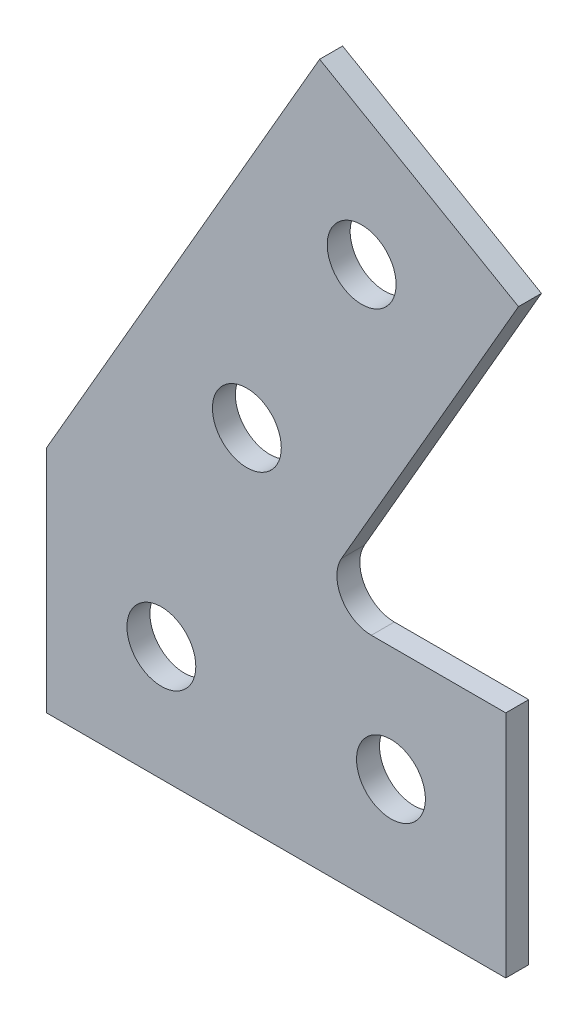
ISO-10303-21;
HEADER;
FILE_DESCRIPTION(('STEP AP214'),'2;1');
FILE_NAME('part.step','',(''),(''),'','','');
FILE_SCHEMA(('AUTOMOTIVE_DESIGN { 1 0 10303 214 1 1 1 1 }'));
ENDSEC;
DATA;
#1=APPLICATION_CONTEXT('core data for automotive mechanical design processes');
#2=APPLICATION_PROTOCOL_DEFINITION('international standard','automotive_design',2000,#1);
#3=PRODUCT_CONTEXT('',#1,'mechanical');
#4=PRODUCT('Part','Part','',(#3));
#5=PRODUCT_RELATED_PRODUCT_CATEGORY('part','',(#4));
#6=PRODUCT_DEFINITION_FORMATION('','',#4);
#7=PRODUCT_DEFINITION_CONTEXT('part definition',#1,'design');
#8=PRODUCT_DEFINITION('design','',#6,#7);
#9=PRODUCT_DEFINITION_SHAPE('','',#8);
#10=(LENGTH_UNIT() NAMED_UNIT(*) SI_UNIT(.MILLI.,.METRE.));
#11=(NAMED_UNIT(*) PLANE_ANGLE_UNIT() SI_UNIT($,.RADIAN.));
#12=(NAMED_UNIT(*) SI_UNIT($,.STERADIAN.) SOLID_ANGLE_UNIT());
#13=UNCERTAINTY_MEASURE_WITH_UNIT(LENGTH_MEASURE(1.E-05),#10,'distance_accuracy_value','');
#14=(GEOMETRIC_REPRESENTATION_CONTEXT(3) GLOBAL_UNCERTAINTY_ASSIGNED_CONTEXT((#13)) GLOBAL_UNIT_ASSIGNED_CONTEXT((#10,
#11,#12)) REPRESENTATION_CONTEXT('',''));
#15=CARTESIAN_POINT('',(0.,0.,0.));
#16=DIRECTION('',(0.,0.,1.));
#17=DIRECTION('',(1.,0.,0.));
#18=AXIS2_PLACEMENT_3D('',#15,#16,#17);
#19=CARTESIAN_POINT('',(14.1450815951458,11.5,1.));
#20=DIRECTION('',(0.,0.,-1.));
#21=DIRECTION('',(-1.,0.,0.));
#22=AXIS2_PLACEMENT_3D('',#19,#20,#21);
#23=PLANE('',#22);
#24=DIRECTION('',(0.,-1.,0.));
#25=VECTOR('',#24,1.);
#26=CARTESIAN_POINT('',(0.,0.,1.));
#27=LINE('',#26,#25);
#28=CARTESIAN_POINT('',(0.,10.,1.));
#29=VERTEX_POINT('',#28);
#30=CARTESIAN_POINT('',(0.,0.,1.));
#31=VERTEX_POINT('',#30);
#32=EDGE_CURVE('E145',#29,#31,#27,.T.);
#33=ORIENTED_EDGE('',*,*,#32,.T.);
#34=DIRECTION('',(1.,0.,0.));
#35=VECTOR('',#34,1.);
#36=CARTESIAN_POINT('',(0.,0.,1.));
#37=LINE('',#36,#35);
#38=CARTESIAN_POINT('',(20.,0.,1.));
#39=VERTEX_POINT('',#38);
#40=EDGE_CURVE('E93',#31,#39,#37,.T.);
#41=ORIENTED_EDGE('',*,*,#40,.T.);
#42=DIRECTION('',(0.,1.,0.));
#43=VECTOR('',#42,1.);
#44=CARTESIAN_POINT('',(20.,0.,1.));
#45=LINE('',#44,#43);
#46=CARTESIAN_POINT('',(20.,10.,1.));
#47=VERTEX_POINT('',#46);
#48=EDGE_CURVE('E160',#39,#47,#45,.T.);
#49=ORIENTED_EDGE('',*,*,#48,.T.);
#50=DIRECTION('',(-1.,0.,0.));
#51=VECTOR('',#50,1.);
#52=CARTESIAN_POINT('',(20.,10.,1.));
#53=LINE('',#52,#51);
#54=CARTESIAN_POINT('',(14.1450815951458,10.,1.));
#55=VERTEX_POINT('',#54);
#56=EDGE_CURVE('E173',#47,#55,#53,.T.);
#57=ORIENTED_EDGE('',*,*,#56,.T.);
#58=CARTESIAN_POINT('',(14.1450815951458,11.5,1.));
#59=DIRECTION('',(0.,0.,-1.));
#60=DIRECTION('',(-1.,0.,0.));
#61=AXIS2_PLACEMENT_3D('',#58,#59,#60);
#62=CIRCLE('',#61,1.5);
#63=CARTESIAN_POINT('',(12.8460434894692,12.25,1.));
#64=VERTEX_POINT('',#63);
#65=EDGE_CURVE('E112',#55,#64,#62,.T.);
#66=ORIENTED_EDGE('',*,*,#65,.T.);
#67=DIRECTION('',(0.500000000000001,0.866025403784438,0.));
#68=VECTOR('',#67,1.);
#69=CARTESIAN_POINT('',(12.8460434894692,12.25,1.));
#70=LINE('',#69,#68);
#71=CARTESIAN_POINT('',(20.5536695831507,25.6,1.));
#72=VERTEX_POINT('',#71);
#73=EDGE_CURVE('E106',#64,#72,#70,.T.);
#74=ORIENTED_EDGE('',*,*,#73,.T.);
#75=DIRECTION('',(-0.866025403784438,0.500000000000001,0.));
#76=VECTOR('',#75,1.);
#77=CARTESIAN_POINT('',(11.8934155453063,30.6,1.));
#78=LINE('',#77,#76);
#79=CARTESIAN_POINT('',(11.8934155453063,30.6,1.));
#80=VERTEX_POINT('',#79);
#81=EDGE_CURVE('E110',#72,#80,#78,.T.);
#82=ORIENTED_EDGE('',*,*,#81,.T.);
#83=DIRECTION('',(-0.500000000000001,-0.866025403784438,0.));
#84=VECTOR('',#83,1.);
#85=CARTESIAN_POINT('',(0.,10.,1.));
#86=LINE('',#85,#84);
#87=EDGE_CURVE('E50',#80,#29,#86,.T.);
#88=ORIENTED_EDGE('',*,*,#87,.T.);
#89=EDGE_LOOP('',(#33,#41,#49,#57,#66,#74,#82,#88));
#90=FACE_BOUND('',#89,.T.);
#91=CARTESIAN_POINT('',(5.,5.,1.));
#92=DIRECTION('',(0.,0.,1.));
#93=DIRECTION('',(1.,0.,0.));
#94=AXIS2_PLACEMENT_3D('',#91,#92,#93);
#95=CIRCLE('',#94,1.5);
#96=CARTESIAN_POINT('',(6.5,5.,1.));
#97=VERTEX_POINT('',#96);
#98=EDGE_CURVE('E134',#97,#97,#95,.T.);
#99=ORIENTED_EDGE('',*,*,#98,.F.);
#100=EDGE_LOOP('',(#99));
#101=FACE_BOUND('',#100,.T.);
#102=CARTESIAN_POINT('',(15.,5.,1.));
#103=DIRECTION('',(0.,0.,1.));
#104=DIRECTION('',(1.,0.,0.));
#105=AXIS2_PLACEMENT_3D('',#102,#103,#104);
#106=CIRCLE('',#105,1.5);
#107=CARTESIAN_POINT('',(16.5,5.,1.));
#108=VERTEX_POINT('',#107);
#109=EDGE_CURVE('E182',#108,#108,#106,.T.);
#110=ORIENTED_EDGE('',*,*,#109,.F.);
#111=EDGE_LOOP('',(#110));
#112=FACE_BOUND('',#111,.T.);
#113=CARTESIAN_POINT('',(8.7235425642285,15.1096189432334,1.));
#114=DIRECTION('',(0.,0.,1.));
#115=DIRECTION('',(1.,0.,0.));
#116=AXIS2_PLACEMENT_3D('',#113,#114,#115);
#117=CIRCLE('',#116,1.5);
#118=CARTESIAN_POINT('',(10.2235425642285,15.1096189432334,1.));
#119=VERTEX_POINT('',#118);
#120=EDGE_CURVE('E188',#119,#119,#117,.T.);
#121=ORIENTED_EDGE('',*,*,#120,.F.);
#122=EDGE_LOOP('',(#121));
#123=FACE_BOUND('',#122,.T.);
#124=CARTESIAN_POINT('',(13.7235425642285,23.7698729810778,1.));
#125=DIRECTION('',(0.,0.,1.));
#126=DIRECTION('',(1.,0.,0.));
#127=AXIS2_PLACEMENT_3D('',#124,#125,#126);
#128=CIRCLE('',#127,1.5);
#129=CARTESIAN_POINT('',(15.2235425642285,23.7698729810778,1.));
#130=VERTEX_POINT('',#129);
#131=EDGE_CURVE('E194',#130,#130,#128,.T.);
#132=ORIENTED_EDGE('',*,*,#131,.F.);
#133=EDGE_LOOP('',(#132));
#134=FACE_BOUND('',#133,.T.);
#135=ADVANCED_FACE('F33',(#90,#101,#112,#123,#134),#23,.F.);
#136=CARTESIAN_POINT('',(14.1450815951458,11.5,0.));
#137=DIRECTION('',(0.,0.,-1.));
#138=DIRECTION('',(-1.,0.,0.));
#139=AXIS2_PLACEMENT_3D('',#136,#137,#138);
#140=PLANE('',#139);
#141=CARTESIAN_POINT('',(8.7235425642285,15.1096189432334,0.));
#142=DIRECTION('',(0.,0.,1.));
#143=DIRECTION('',(1.,0.,0.));
#144=AXIS2_PLACEMENT_3D('',#141,#142,#143);
#145=CIRCLE('',#144,1.5);
#146=CARTESIAN_POINT('',(10.2235425642285,15.1096189432334,0.));
#147=VERTEX_POINT('',#146);
#148=EDGE_CURVE('E191',#147,#147,#145,.T.);
#149=ORIENTED_EDGE('',*,*,#148,.T.);
#150=EDGE_LOOP('',(#149));
#151=FACE_BOUND('',#150,.T.);
#152=CARTESIAN_POINT('',(5.,5.,0.));
#153=DIRECTION('',(0.,0.,1.));
#154=DIRECTION('',(1.,0.,0.));
#155=AXIS2_PLACEMENT_3D('',#152,#153,#154);
#156=CIRCLE('',#155,1.5);
#157=CARTESIAN_POINT('',(6.5,5.,0.));
#158=VERTEX_POINT('',#157);
#159=EDGE_CURVE('E179',#158,#158,#156,.T.);
#160=ORIENTED_EDGE('',*,*,#159,.T.);
#161=EDGE_LOOP('',(#160));
#162=FACE_BOUND('',#161,.T.);
#163=DIRECTION('',(0.,-1.,0.));
#164=VECTOR('',#163,1.);
#165=CARTESIAN_POINT('',(0.,0.,0.));
#166=LINE('',#165,#164);
#167=CARTESIAN_POINT('',(0.,10.,0.));
#168=VERTEX_POINT('',#167);
#169=CARTESIAN_POINT('',(0.,0.,0.));
#170=VERTEX_POINT('',#169);
#171=EDGE_CURVE('E130',#168,#170,#166,.T.);
#172=ORIENTED_EDGE('',*,*,#171,.F.);
#173=DIRECTION('',(-0.500000000000001,-0.866025403784438,0.));
#174=VECTOR('',#173,1.);
#175=CARTESIAN_POINT('',(0.,10.,0.));
#176=LINE('',#175,#174);
#177=CARTESIAN_POINT('',(11.8934155453063,30.6,0.));
#178=VERTEX_POINT('',#177);
#179=EDGE_CURVE('E85',#178,#168,#176,.T.);
#180=ORIENTED_EDGE('',*,*,#179,.F.);
#181=DIRECTION('',(-0.866025403784438,0.500000000000001,0.));
#182=VECTOR('',#181,1.);
#183=CARTESIAN_POINT('',(11.8934155453063,30.6,0.));
#184=LINE('',#183,#182);
#185=CARTESIAN_POINT('',(20.5536695831507,25.6,0.));
#186=VERTEX_POINT('',#185);
#187=EDGE_CURVE('E79',#186,#178,#184,.T.);
#188=ORIENTED_EDGE('',*,*,#187,.F.);
#189=DIRECTION('',(0.500000000000001,0.866025403784438,0.));
#190=VECTOR('',#189,1.);
#191=CARTESIAN_POINT('',(12.8460434894692,12.25,0.));
#192=LINE('',#191,#190);
#193=CARTESIAN_POINT('',(12.8460434894692,12.25,0.));
#194=VERTEX_POINT('',#193);
#195=EDGE_CURVE('E120',#194,#186,#192,.T.);
#196=ORIENTED_EDGE('',*,*,#195,.F.);
#197=CARTESIAN_POINT('',(14.1450815951458,11.5,0.));
#198=DIRECTION('',(0.,0.,-1.));
#199=DIRECTION('',(-1.,0.,0.));
#200=AXIS2_PLACEMENT_3D('',#197,#198,#199);
#201=CIRCLE('',#200,1.5);
#202=CARTESIAN_POINT('',(14.1450815951458,10.,0.));
#203=VERTEX_POINT('',#202);
#204=EDGE_CURVE('E140',#203,#194,#201,.T.);
#205=ORIENTED_EDGE('',*,*,#204,.F.);
#206=DIRECTION('',(-1.,0.,0.));
#207=VECTOR('',#206,1.);
#208=CARTESIAN_POINT('',(20.,10.,0.));
#209=LINE('',#208,#207);
#210=CARTESIAN_POINT('',(20.,10.,0.));
#211=VERTEX_POINT('',#210);
#212=EDGE_CURVE('E138',#211,#203,#209,.T.);
#213=ORIENTED_EDGE('',*,*,#212,.F.);
#214=DIRECTION('',(0.,1.,0.));
#215=VECTOR('',#214,1.);
#216=CARTESIAN_POINT('',(20.,0.,0.));
#217=LINE('',#216,#215);
#218=CARTESIAN_POINT('',(20.,0.,0.));
#219=VERTEX_POINT('',#218);
#220=EDGE_CURVE('E136',#219,#211,#217,.T.);
#221=ORIENTED_EDGE('',*,*,#220,.F.);
#222=DIRECTION('',(1.,0.,0.));
#223=VECTOR('',#222,1.);
#224=CARTESIAN_POINT('',(0.,0.,0.));
#225=LINE('',#224,#223);
#226=EDGE_CURVE('E133',#170,#219,#225,.T.);
#227=ORIENTED_EDGE('',*,*,#226,.F.);
#228=EDGE_LOOP('',(#172,#180,#188,#196,#205,#213,#221,#227));
#229=FACE_BOUND('',#228,.T.);
#230=CARTESIAN_POINT('',(15.,5.,0.));
#231=DIRECTION('',(0.,0.,1.));
#232=DIRECTION('',(1.,0.,0.));
#233=AXIS2_PLACEMENT_3D('',#230,#231,#232);
#234=CIRCLE('',#233,1.5);
#235=CARTESIAN_POINT('',(16.5,5.,0.));
#236=VERTEX_POINT('',#235);
#237=EDGE_CURVE('E185',#236,#236,#234,.T.);
#238=ORIENTED_EDGE('',*,*,#237,.T.);
#239=EDGE_LOOP('',(#238));
#240=FACE_BOUND('',#239,.T.);
#241=CARTESIAN_POINT('',(13.7235425642285,23.7698729810778,0.));
#242=DIRECTION('',(0.,0.,1.));
#243=DIRECTION('',(1.,0.,0.));
#244=AXIS2_PLACEMENT_3D('',#241,#242,#243);
#245=CIRCLE('',#244,1.5);
#246=CARTESIAN_POINT('',(15.2235425642285,23.7698729810778,0.));
#247=VERTEX_POINT('',#246);
#248=EDGE_CURVE('E197',#247,#247,#245,.T.);
#249=ORIENTED_EDGE('',*,*,#248,.T.);
#250=EDGE_LOOP('',(#249));
#251=FACE_BOUND('',#250,.T.);
#252=ADVANCED_FACE('F164',(#151,#162,#229,#240,#251),#140,.T.);
#253=CARTESIAN_POINT('',(0.,0.,1.));
#254=DIRECTION('',(1.,0.,0.));
#255=DIRECTION('',(0.,0.,-1.));
#256=AXIS2_PLACEMENT_3D('',#253,#254,#255);
#257=PLANE('',#256);
#258=ORIENTED_EDGE('',*,*,#171,.T.);
#259=DIRECTION('',(0.,0.,-1.));
#260=VECTOR('',#259,1.);
#261=CARTESIAN_POINT('',(0.,0.,1.));
#262=LINE('',#261,#260);
#263=EDGE_CURVE('E11',#31,#170,#262,.T.);
#264=ORIENTED_EDGE('',*,*,#263,.F.);
#265=ORIENTED_EDGE('',*,*,#32,.F.);
#266=DIRECTION('',(0.,0.,-1.));
#267=VECTOR('',#266,1.);
#268=CARTESIAN_POINT('',(0.,10.,1.));
#269=LINE('',#268,#267);
#270=EDGE_CURVE('E126',#29,#168,#269,.T.);
#271=ORIENTED_EDGE('',*,*,#270,.T.);
#272=EDGE_LOOP('',(#258,#264,#265,#271));
#273=FACE_BOUND('',#272,.T.);
#274=ADVANCED_FACE('F35',(#273),#257,.F.);
#275=CARTESIAN_POINT('',(0.,0.,1.));
#276=DIRECTION('',(0.,1.,0.));
#277=DIRECTION('',(0.,0.,1.));
#278=AXIS2_PLACEMENT_3D('',#275,#276,#277);
#279=PLANE('',#278);
#280=ORIENTED_EDGE('',*,*,#226,.T.);
#281=DIRECTION('',(0.,0.,-1.));
#282=VECTOR('',#281,1.);
#283=CARTESIAN_POINT('',(20.,0.,1.));
#284=LINE('',#283,#282);
#285=EDGE_CURVE('E42',#39,#219,#284,.T.);
#286=ORIENTED_EDGE('',*,*,#285,.F.);
#287=ORIENTED_EDGE('',*,*,#40,.F.);
#288=ORIENTED_EDGE('',*,*,#263,.T.);
#289=EDGE_LOOP('',(#280,#286,#287,#288));
#290=FACE_BOUND('',#289,.T.);
#291=ADVANCED_FACE('F229',(#290),#279,.F.);
#292=CARTESIAN_POINT('',(20.,0.,1.));
#293=DIRECTION('',(-1.,0.,0.));
#294=DIRECTION('',(0.,0.,1.));
#295=AXIS2_PLACEMENT_3D('',#292,#293,#294);
#296=PLANE('',#295);
#297=ORIENTED_EDGE('',*,*,#220,.T.);
#298=DIRECTION('',(0.,0.,-1.));
#299=VECTOR('',#298,1.);
#300=CARTESIAN_POINT('',(20.,10.,1.));
#301=LINE('',#300,#299);
#302=EDGE_CURVE('E152',#47,#211,#301,.T.);
#303=ORIENTED_EDGE('',*,*,#302,.F.);
#304=ORIENTED_EDGE('',*,*,#48,.F.);
#305=ORIENTED_EDGE('',*,*,#285,.T.);
#306=EDGE_LOOP('',(#297,#303,#304,#305));
#307=FACE_BOUND('',#306,.T.);
#308=ADVANCED_FACE('F158',(#307),#296,.F.);
#309=CARTESIAN_POINT('',(20.,10.,1.));
#310=DIRECTION('',(0.,-1.,0.));
#311=DIRECTION('',(0.,0.,-1.));
#312=AXIS2_PLACEMENT_3D('',#309,#310,#311);
#313=PLANE('',#312);
#314=ORIENTED_EDGE('',*,*,#212,.T.);
#315=DIRECTION('',(0.,0.,-1.));
#316=VECTOR('',#315,1.);
#317=CARTESIAN_POINT('',(14.1450815951458,10.,1.));
#318=LINE('',#317,#316);
#319=EDGE_CURVE('E149',#55,#203,#318,.T.);
#320=ORIENTED_EDGE('',*,*,#319,.F.);
#321=ORIENTED_EDGE('',*,*,#56,.F.);
#322=ORIENTED_EDGE('',*,*,#302,.T.);
#323=EDGE_LOOP('',(#314,#320,#321,#322));
#324=FACE_BOUND('',#323,.T.);
#325=ADVANCED_FACE('F169',(#324),#313,.F.);
#326=CARTESIAN_POINT('',(14.1450815951458,11.5,1.));
#327=DIRECTION('',(0.,0.,-1.));
#328=DIRECTION('',(-1.,0.,0.));
#329=AXIS2_PLACEMENT_3D('',#326,#327,#328);
#330=CYLINDRICAL_SURFACE('',#329,1.5);
#331=ORIENTED_EDGE('',*,*,#204,.T.);
#332=DIRECTION('',(0.,0.,-1.));
#333=VECTOR('',#332,1.);
#334=CARTESIAN_POINT('',(12.8460434894692,12.25,1.));
#335=LINE('',#334,#333);
#336=EDGE_CURVE('E121',#64,#194,#335,.T.);
#337=ORIENTED_EDGE('',*,*,#336,.F.);
#338=ORIENTED_EDGE('',*,*,#65,.F.);
#339=ORIENTED_EDGE('',*,*,#319,.T.);
#340=EDGE_LOOP('',(#331,#337,#338,#339));
#341=FACE_BOUND('',#340,.T.);
#342=ADVANCED_FACE('F172',(#341),#330,.F.);
#343=CARTESIAN_POINT('',(12.8460434894692,12.25,1.));
#344=DIRECTION('',(-0.866025403784438,0.500000000000001,0.));
#345=DIRECTION('',(-0.500000000000001,-0.866025403784438,0.));
#346=AXIS2_PLACEMENT_3D('',#343,#344,#345);
#347=PLANE('',#346);
#348=ORIENTED_EDGE('',*,*,#195,.T.);
#349=DIRECTION('',(0.,0.,-1.));
#350=VECTOR('',#349,1.);
#351=CARTESIAN_POINT('',(20.5536695831507,25.6,1.));
#352=LINE('',#351,#350);
#353=EDGE_CURVE('E117',#72,#186,#352,.T.);
#354=ORIENTED_EDGE('',*,*,#353,.F.);
#355=ORIENTED_EDGE('',*,*,#73,.F.);
#356=ORIENTED_EDGE('',*,*,#336,.T.);
#357=EDGE_LOOP('',(#348,#354,#355,#356));
#358=FACE_BOUND('',#357,.T.);
#359=ADVANCED_FACE('F118',(#358),#347,.F.);
#360=CARTESIAN_POINT('',(11.8934155453063,30.6,1.));
#361=DIRECTION('',(-0.500000000000001,-0.866025403784438,0.));
#362=DIRECTION('',(0.866025403784438,-0.500000000000001,0.));
#363=AXIS2_PLACEMENT_3D('',#360,#361,#362);
#364=PLANE('',#363);
#365=ORIENTED_EDGE('',*,*,#187,.T.);
#366=DIRECTION('',(0.,0.,-1.));
#367=VECTOR('',#366,1.);
#368=CARTESIAN_POINT('',(11.8934155453063,30.6,1.));
#369=LINE('',#368,#367);
#370=EDGE_CURVE('E122',#80,#178,#369,.T.);
#371=ORIENTED_EDGE('',*,*,#370,.F.);
#372=ORIENTED_EDGE('',*,*,#81,.F.);
#373=ORIENTED_EDGE('',*,*,#353,.T.);
#374=EDGE_LOOP('',(#365,#371,#372,#373));
#375=FACE_BOUND('',#374,.T.);
#376=ADVANCED_FACE('F124',(#375),#364,.F.);
#377=CARTESIAN_POINT('',(0.,10.,1.));
#378=DIRECTION('',(0.866025403784438,-0.500000000000001,0.));
#379=DIRECTION('',(0.500000000000001,0.866025403784438,0.));
#380=AXIS2_PLACEMENT_3D('',#377,#378,#379);
#381=PLANE('',#380);
#382=ORIENTED_EDGE('',*,*,#179,.T.);
#383=ORIENTED_EDGE('',*,*,#270,.F.);
#384=ORIENTED_EDGE('',*,*,#87,.F.);
#385=ORIENTED_EDGE('',*,*,#370,.T.);
#386=EDGE_LOOP('',(#382,#383,#384,#385));
#387=FACE_BOUND('',#386,.T.);
#388=ADVANCED_FACE('F217',(#387),#381,.F.);
#389=CARTESIAN_POINT('',(5.,5.,1.));
#390=DIRECTION('',(0.,0.,-1.));
#391=DIRECTION('',(-1.,0.,0.));
#392=AXIS2_PLACEMENT_3D('',#389,#390,#391);
#393=CYLINDRICAL_SURFACE('',#392,1.5);
#394=ORIENTED_EDGE('',*,*,#98,.T.);
#395=EDGE_LOOP('',(#394));
#396=FACE_BOUND('',#395,.T.);
#397=ORIENTED_EDGE('',*,*,#159,.F.);
#398=EDGE_LOOP('',(#397));
#399=FACE_BOUND('',#398,.T.);
#400=ADVANCED_FACE('F214',(#396,#399),#393,.F.);
#401=CARTESIAN_POINT('',(15.,5.,1.));
#402=DIRECTION('',(0.,0.,-1.));
#403=DIRECTION('',(-1.,0.,0.));
#404=AXIS2_PLACEMENT_3D('',#401,#402,#403);
#405=CYLINDRICAL_SURFACE('',#404,1.5);
#406=ORIENTED_EDGE('',*,*,#109,.T.);
#407=EDGE_LOOP('',(#406));
#408=FACE_BOUND('',#407,.T.);
#409=ORIENTED_EDGE('',*,*,#237,.F.);
#410=EDGE_LOOP('',(#409));
#411=FACE_BOUND('',#410,.T.);
#412=ADVANCED_FACE('F293',(#408,#411),#405,.F.);
#413=CARTESIAN_POINT('',(8.7235425642285,15.1096189432334,1.));
#414=DIRECTION('',(0.,0.,-1.));
#415=DIRECTION('',(-1.,0.,0.));
#416=AXIS2_PLACEMENT_3D('',#413,#414,#415);
#417=CYLINDRICAL_SURFACE('',#416,1.5);
#418=ORIENTED_EDGE('',*,*,#120,.T.);
#419=EDGE_LOOP('',(#418));
#420=FACE_BOUND('',#419,.T.);
#421=ORIENTED_EDGE('',*,*,#148,.F.);
#422=EDGE_LOOP('',(#421));
#423=FACE_BOUND('',#422,.T.);
#424=ADVANCED_FACE('F301',(#420,#423),#417,.F.);
#425=CARTESIAN_POINT('',(13.7235425642285,23.7698729810778,1.));
#426=DIRECTION('',(0.,0.,-1.));
#427=DIRECTION('',(-1.,0.,0.));
#428=AXIS2_PLACEMENT_3D('',#425,#426,#427);
#429=CYLINDRICAL_SURFACE('',#428,1.5);
#430=ORIENTED_EDGE('',*,*,#131,.T.);
#431=EDGE_LOOP('',(#430));
#432=FACE_BOUND('',#431,.T.);
#433=ORIENTED_EDGE('',*,*,#248,.F.);
#434=EDGE_LOOP('',(#433));
#435=FACE_BOUND('',#434,.T.);
#436=ADVANCED_FACE('F203',(#432,#435),#429,.F.);
#437=CLOSED_SHELL('',(#135,#252,#274,#291,#308,#325,#342,#359,#376,#388,#400,#412,#424,#436));
#438=MANIFOLD_SOLID_BREP('B2',#437);
#439=ADVANCED_BREP_SHAPE_REPRESENTATION('',(#18,#438),#14);
#440=SHAPE_DEFINITION_REPRESENTATION(#9,#439);
ENDSEC;
END-ISO-10303-21;
